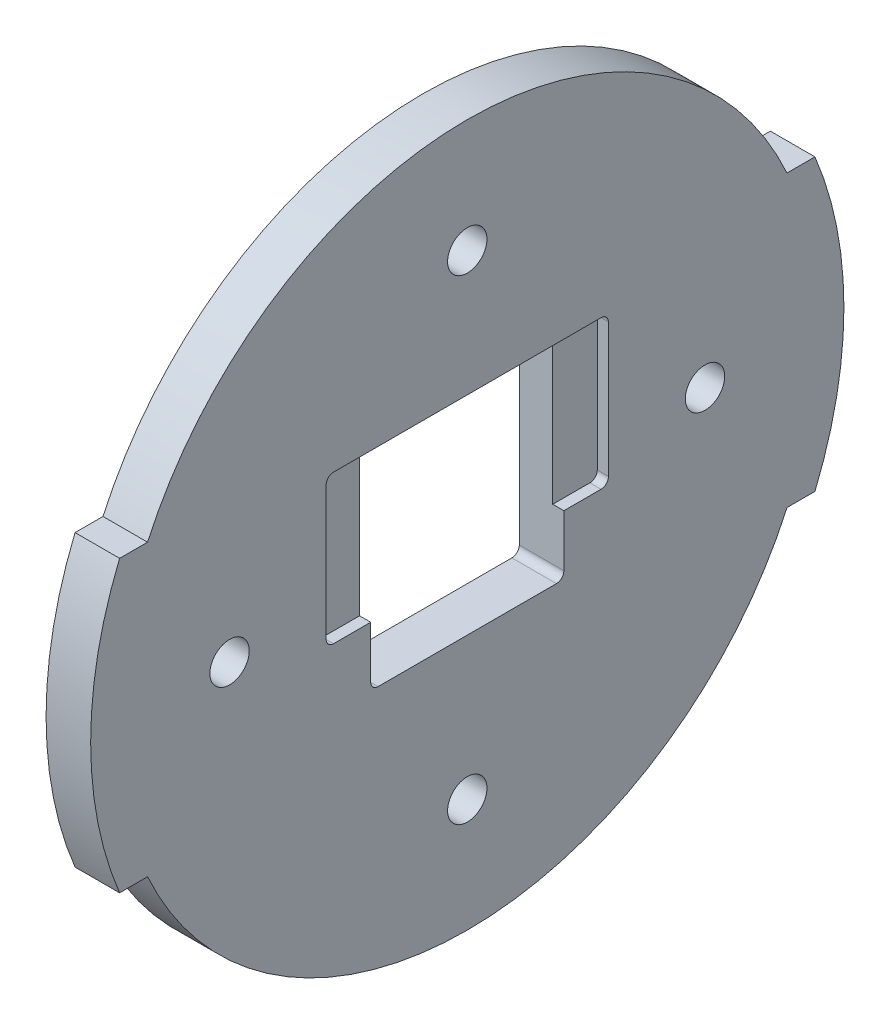
ISO-10303-21;
HEADER;
FILE_DESCRIPTION(('STEP AP214'),'2;1');
FILE_NAME('part.step','',(''),(''),'','','');
FILE_SCHEMA(('AUTOMOTIVE_DESIGN { 1 0 10303 214 1 1 1 1 }'));
ENDSEC;
DATA;
#1=APPLICATION_CONTEXT('core data for automotive mechanical design processes');
#2=APPLICATION_PROTOCOL_DEFINITION('international standard','automotive_design',2000,#1);
#3=PRODUCT_CONTEXT('',#1,'mechanical');
#4=PRODUCT('Part','Part','',(#3));
#5=PRODUCT_RELATED_PRODUCT_CATEGORY('part','',(#4));
#6=PRODUCT_DEFINITION_FORMATION('','',#4);
#7=PRODUCT_DEFINITION_CONTEXT('part definition',#1,'design');
#8=PRODUCT_DEFINITION('design','',#6,#7);
#9=PRODUCT_DEFINITION_SHAPE('','',#8);
#10=(LENGTH_UNIT() NAMED_UNIT(*) SI_UNIT(.MILLI.,.METRE.));
#11=(NAMED_UNIT(*) PLANE_ANGLE_UNIT() SI_UNIT($,.RADIAN.));
#12=(NAMED_UNIT(*) SI_UNIT($,.STERADIAN.) SOLID_ANGLE_UNIT());
#13=UNCERTAINTY_MEASURE_WITH_UNIT(LENGTH_MEASURE(1.E-05),#10,'distance_accuracy_value','');
#14=(GEOMETRIC_REPRESENTATION_CONTEXT(3) GLOBAL_UNCERTAINTY_ASSIGNED_CONTEXT((#13)) GLOBAL_UNIT_ASSIGNED_CONTEXT((#10,
#11,#12)) REPRESENTATION_CONTEXT('',''));
#15=CARTESIAN_POINT('',(0.,0.,0.));
#16=DIRECTION('',(0.,0.,1.));
#17=DIRECTION('',(1.,0.,0.));
#18=AXIS2_PLACEMENT_3D('',#15,#16,#17);
#19=CARTESIAN_POINT('',(6.,0.,0.));
#20=DIRECTION('',(1.,0.,0.));
#21=DIRECTION('',(0.,0.,-1.));
#22=AXIS2_PLACEMENT_3D('',#19,#20,#21);
#23=PLANE('',#22);
#24=CARTESIAN_POINT('',(6.,0.,-32.));
#25=DIRECTION('',(1.,0.,0.));
#26=DIRECTION('',(0.,0.,-1.));
#27=AXIS2_PLACEMENT_3D('',#24,#25,#26);
#28=CIRCLE('',#27,2.64999999999999);
#29=CARTESIAN_POINT('',(6.,0.,-34.65));
#30=VERTEX_POINT('',#29);
#31=EDGE_CURVE('E416',#30,#30,#28,.T.);
#32=ORIENTED_EDGE('',*,*,#31,.F.);
#33=EDGE_LOOP('',(#32));
#34=FACE_BOUND('',#33,.T.);
#35=CARTESIAN_POINT('',(6.,32.,1.1172740284298E-13));
#36=DIRECTION('',(1.,0.,0.));
#37=DIRECTION('',(0.,0.,-1.));
#38=AXIS2_PLACEMENT_3D('',#35,#36,#37);
#39=CIRCLE('',#38,2.64999999999999);
#40=CARTESIAN_POINT('',(6.,32.,-2.64999999999987));
#41=VERTEX_POINT('',#40);
#42=EDGE_CURVE('E422',#41,#41,#39,.T.);
#43=ORIENTED_EDGE('',*,*,#42,.F.);
#44=EDGE_LOOP('',(#43));
#45=FACE_BOUND('',#44,.T.);
#46=CARTESIAN_POINT('',(6.,-2.23454805685961E-13,32.));
#47=DIRECTION('',(1.,0.,0.));
#48=DIRECTION('',(0.,0.,-1.));
#49=AXIS2_PLACEMENT_3D('',#46,#47,#48);
#50=CIRCLE('',#49,2.64999999999999);
#51=CARTESIAN_POINT('',(6.,-2.23454805685961E-13,29.35));
#52=VERTEX_POINT('',#51);
#53=EDGE_CURVE('E428',#52,#52,#50,.T.);
#54=ORIENTED_EDGE('',*,*,#53,.F.);
#55=EDGE_LOOP('',(#54));
#56=FACE_BOUND('',#55,.T.);
#57=CARTESIAN_POINT('',(6.,-32.,-3.35182208528941E-13));
#58=DIRECTION('',(1.,0.,0.));
#59=DIRECTION('',(0.,0.,-1.));
#60=AXIS2_PLACEMENT_3D('',#57,#58,#59);
#61=CIRCLE('',#60,2.64999999999999);
#62=CARTESIAN_POINT('',(6.,-32.,-2.65000000000032));
#63=VERTEX_POINT('',#62);
#64=EDGE_CURVE('E434',#63,#63,#61,.T.);
#65=ORIENTED_EDGE('',*,*,#64,.F.);
#66=EDGE_LOOP('',(#65));
#67=FACE_BOUND('',#66,.T.);
#68=CARTESIAN_POINT('',(6.,0.,0.));
#69=DIRECTION('',(1.,0.,0.));
#70=DIRECTION('',(0.,0.,-1.));
#71=AXIS2_PLACEMENT_3D('',#68,#69,#70);
#72=CIRCLE('',#71,50.7);
#73=CARTESIAN_POINT('',(6.,19.5,46.8));
#74=VERTEX_POINT('',#73);
#75=CARTESIAN_POINT('',(6.,-19.5,46.8));
#76=VERTEX_POINT('',#75);
#77=EDGE_CURVE('E264',#74,#76,#72,.T.);
#78=ORIENTED_EDGE('',*,*,#77,.T.);
#79=DIRECTION('',(0.,0.,-1.));
#80=VECTOR('',#79,1.);
#81=CARTESIAN_POINT('',(6.,-19.5,46.8));
#82=LINE('',#81,#80);
#83=CARTESIAN_POINT('',(6.,-19.5,43.0385002062107));
#84=VERTEX_POINT('',#83);
#85=EDGE_CURVE('E267',#76,#84,#82,.T.);
#86=ORIENTED_EDGE('',*,*,#85,.T.);
#87=CARTESIAN_POINT('',(6.,0.,0.));
#88=DIRECTION('',(1.,0.,0.));
#89=DIRECTION('',(0.,0.,-1.));
#90=AXIS2_PLACEMENT_3D('',#87,#88,#89);
#91=CIRCLE('',#90,47.25);
#92=CARTESIAN_POINT('',(6.,-19.5,-43.0385002062107));
#93=VERTEX_POINT('',#92);
#94=EDGE_CURVE('E270',#84,#93,#91,.T.);
#95=ORIENTED_EDGE('',*,*,#94,.T.);
#96=DIRECTION('',(0.,0.,-1.));
#97=VECTOR('',#96,1.);
#98=CARTESIAN_POINT('',(6.,-19.5,-46.8));
#99=LINE('',#98,#97);
#100=CARTESIAN_POINT('',(6.,-19.5,-46.8));
#101=VERTEX_POINT('',#100);
#102=EDGE_CURVE('E272',#93,#101,#99,.T.);
#103=ORIENTED_EDGE('',*,*,#102,.T.);
#104=CARTESIAN_POINT('',(6.,0.,0.));
#105=DIRECTION('',(1.,0.,0.));
#106=DIRECTION('',(0.,0.,-1.));
#107=AXIS2_PLACEMENT_3D('',#104,#105,#106);
#108=CIRCLE('',#107,50.7);
#109=CARTESIAN_POINT('',(6.,19.5,-46.8));
#110=VERTEX_POINT('',#109);
#111=EDGE_CURVE('E274',#101,#110,#108,.T.);
#112=ORIENTED_EDGE('',*,*,#111,.T.);
#113=DIRECTION('',(0.,0.,1.));
#114=VECTOR('',#113,1.);
#115=CARTESIAN_POINT('',(6.,19.5,-46.8));
#116=LINE('',#115,#114);
#117=CARTESIAN_POINT('',(6.,19.5,-43.0385002062107));
#118=VERTEX_POINT('',#117);
#119=EDGE_CURVE('E276',#110,#118,#116,.T.);
#120=ORIENTED_EDGE('',*,*,#119,.T.);
#121=CARTESIAN_POINT('',(6.,0.,0.));
#122=DIRECTION('',(1.,0.,0.));
#123=DIRECTION('',(0.,0.,-1.));
#124=AXIS2_PLACEMENT_3D('',#121,#122,#123);
#125=CIRCLE('',#124,47.25);
#126=CARTESIAN_POINT('',(6.,19.5,43.0385002062107));
#127=VERTEX_POINT('',#126);
#128=EDGE_CURVE('E278',#118,#127,#125,.T.);
#129=ORIENTED_EDGE('',*,*,#128,.T.);
#130=DIRECTION('',(0.,0.,1.));
#131=VECTOR('',#130,1.);
#132=CARTESIAN_POINT('',(6.,19.5,46.8));
#133=LINE('',#132,#131);
#134=EDGE_CURVE('E280',#127,#74,#133,.T.);
#135=ORIENTED_EDGE('',*,*,#134,.T.);
#136=EDGE_LOOP('',(#78,#86,#95,#103,#112,#120,#129,#135));
#137=FACE_BOUND('',#136,.T.);
#138=DIRECTION('',(0.,1.,0.));
#139=VECTOR('',#138,1.);
#140=CARTESIAN_POINT('',(6.,0.,13.));
#141=LINE('',#140,#139);
#142=CARTESIAN_POINT('',(6.,-11.85,13.));
#143=VERTEX_POINT('',#142);
#144=CARTESIAN_POINT('',(6.,-4.85,13.));
#145=VERTEX_POINT('',#144);
#146=EDGE_CURVE('E437',#143,#145,#141,.T.);
#147=ORIENTED_EDGE('',*,*,#146,.T.);
#148=DIRECTION('',(0.,0.,1.));
#149=VECTOR('',#148,1.);
#150=CARTESIAN_POINT('',(6.,-4.85000000000001,0.));
#151=LINE('',#150,#149);
#152=CARTESIAN_POINT('',(6.,-4.85,18.));
#153=VERTEX_POINT('',#152);
#154=EDGE_CURVE('E218',#145,#153,#151,.T.);
#155=ORIENTED_EDGE('',*,*,#154,.T.);
#156=CARTESIAN_POINT('',(6.,-3.85,18.));
#157=DIRECTION('',(1.,0.,0.));
#158=DIRECTION('',(0.,0.,-1.));
#159=AXIS2_PLACEMENT_3D('',#156,#157,#158);
#160=CIRCLE('',#159,1.);
#161=CARTESIAN_POINT('',(6.,-3.85,19.));
#162=VERTEX_POINT('',#161);
#163=EDGE_CURVE('E369',#153,#162,#160,.F.);
#164=ORIENTED_EDGE('',*,*,#163,.T.);
#165=DIRECTION('',(0.,-1.,0.));
#166=VECTOR('',#165,1.);
#167=CARTESIAN_POINT('',(6.,0.,19.));
#168=LINE('',#167,#166);
#169=CARTESIAN_POINT('',(6.,14.15,19.));
#170=VERTEX_POINT('',#169);
#171=EDGE_CURVE('E377',#170,#162,#168,.T.);
#172=ORIENTED_EDGE('',*,*,#171,.F.);
#173=CARTESIAN_POINT('',(6.,14.15,18.));
#174=DIRECTION('',(1.,0.,0.));
#175=DIRECTION('',(0.,0.,-1.));
#176=AXIS2_PLACEMENT_3D('',#173,#174,#175);
#177=CIRCLE('',#176,1.);
#178=CARTESIAN_POINT('',(6.,15.15,18.));
#179=VERTEX_POINT('',#178);
#180=EDGE_CURVE('E11',#170,#179,#177,.F.);
#181=ORIENTED_EDGE('',*,*,#180,.T.);
#182=DIRECTION('',(0.,0.,1.));
#183=VECTOR('',#182,1.);
#184=CARTESIAN_POINT('',(6.,15.15,0.));
#185=LINE('',#184,#183);
#186=CARTESIAN_POINT('',(6.,15.15,-18.));
#187=VERTEX_POINT('',#186);
#188=EDGE_CURVE('E235',#187,#179,#185,.T.);
#189=ORIENTED_EDGE('',*,*,#188,.F.);
#190=CARTESIAN_POINT('',(6.,14.15,-18.));
#191=DIRECTION('',(1.,0.,0.));
#192=DIRECTION('',(0.,0.,-1.));
#193=AXIS2_PLACEMENT_3D('',#190,#191,#192);
#194=CIRCLE('',#193,1.);
#195=CARTESIAN_POINT('',(6.,14.15,-19.));
#196=VERTEX_POINT('',#195);
#197=EDGE_CURVE('E44',#187,#196,#194,.F.);
#198=ORIENTED_EDGE('',*,*,#197,.T.);
#199=DIRECTION('',(0.,-1.,0.));
#200=VECTOR('',#199,1.);
#201=CARTESIAN_POINT('',(6.,0.,-19.));
#202=LINE('',#201,#200);
#203=CARTESIAN_POINT('',(6.,-3.85000000000001,-19.));
#204=VERTEX_POINT('',#203);
#205=EDGE_CURVE('E217',#196,#204,#202,.T.);
#206=ORIENTED_EDGE('',*,*,#205,.T.);
#207=CARTESIAN_POINT('',(6.,-3.85000000000001,-18.));
#208=DIRECTION('',(1.,0.,0.));
#209=DIRECTION('',(0.,0.,-1.));
#210=AXIS2_PLACEMENT_3D('',#207,#208,#209);
#211=CIRCLE('',#210,1.);
#212=CARTESIAN_POINT('',(6.,-4.85000000000001,-18.));
#213=VERTEX_POINT('',#212);
#214=EDGE_CURVE('E214',#204,#213,#211,.F.);
#215=ORIENTED_EDGE('',*,*,#214,.T.);
#216=CARTESIAN_POINT('',(6.,-4.85000000000001,-13.));
#217=VERTEX_POINT('',#216);
#218=EDGE_CURVE('E207',#213,#217,#151,.T.);
#219=ORIENTED_EDGE('',*,*,#218,.T.);
#220=DIRECTION('',(0.,1.,0.));
#221=VECTOR('',#220,1.);
#222=CARTESIAN_POINT('',(6.,0.,-13.));
#223=LINE('',#222,#221);
#224=CARTESIAN_POINT('',(6.,-11.85,-13.));
#225=VERTEX_POINT('',#224);
#226=EDGE_CURVE('E212',#225,#217,#223,.T.);
#227=ORIENTED_EDGE('',*,*,#226,.F.);
#228=CARTESIAN_POINT('',(6.,-11.85,-12.));
#229=DIRECTION('',(1.,0.,0.));
#230=DIRECTION('',(0.,0.,-1.));
#231=AXIS2_PLACEMENT_3D('',#228,#229,#230);
#232=CIRCLE('',#231,1.);
#233=CARTESIAN_POINT('',(6.,-12.85,-12.));
#234=VERTEX_POINT('',#233);
#235=EDGE_CURVE('E236',#225,#234,#232,.F.);
#236=ORIENTED_EDGE('',*,*,#235,.T.);
#237=DIRECTION('',(0.,0.,1.));
#238=VECTOR('',#237,1.);
#239=CARTESIAN_POINT('',(6.,-12.85,0.));
#240=LINE('',#239,#238);
#241=CARTESIAN_POINT('',(6.,-12.85,12.));
#242=VERTEX_POINT('',#241);
#243=EDGE_CURVE('E240',#234,#242,#240,.T.);
#244=ORIENTED_EDGE('',*,*,#243,.T.);
#245=CARTESIAN_POINT('',(6.,-11.85,12.));
#246=DIRECTION('',(1.,0.,0.));
#247=DIRECTION('',(0.,0.,-1.));
#248=AXIS2_PLACEMENT_3D('',#245,#246,#247);
#249=CIRCLE('',#248,1.);
#250=EDGE_CURVE('E439',#143,#242,#249,.T.);
#251=ORIENTED_EDGE('',*,*,#250,.F.);
#252=EDGE_LOOP('',(#147,#155,#164,#172,#181,#189,#198,#206,#215,#219,#227,#236,#244,#251));
#253=FACE_BOUND('',#252,.T.);
#254=ADVANCED_FACE('F36',(#34,#45,#56,#67,#137,#253),#23,.T.);
#255=CARTESIAN_POINT('',(-14.,0.,13.));
#256=DIRECTION('',(0.,0.,-1.));
#257=DIRECTION('',(-1.,0.,0.));
#258=AXIS2_PLACEMENT_3D('',#255,#256,#257);
#259=PLANE('',#258);
#260=DIRECTION('',(0.,-1.,0.));
#261=VECTOR('',#260,1.);
#262=CARTESIAN_POINT('',(4.5,0.,13.));
#263=LINE('',#262,#261);
#264=CARTESIAN_POINT('',(4.5,14.15,13.));
#265=VERTEX_POINT('',#264);
#266=CARTESIAN_POINT('',(4.5,-4.85,13.));
#267=VERTEX_POINT('',#266);
#268=EDGE_CURVE('E407',#265,#267,#263,.T.);
#269=ORIENTED_EDGE('',*,*,#268,.T.);
#270=DIRECTION('',(1.,0.,0.));
#271=VECTOR('',#270,1.);
#272=CARTESIAN_POINT('',(-14.,-4.85,13.));
#273=LINE('',#272,#271);
#274=EDGE_CURVE('E410',#267,#145,#273,.T.);
#275=ORIENTED_EDGE('',*,*,#274,.T.);
#276=ORIENTED_EDGE('',*,*,#146,.F.);
#277=DIRECTION('',(1.,0.,0.));
#278=VECTOR('',#277,1.);
#279=CARTESIAN_POINT('',(-14.,-11.85,13.));
#280=LINE('',#279,#278);
#281=CARTESIAN_POINT('',(0.,-11.85,13.));
#282=VERTEX_POINT('',#281);
#283=EDGE_CURVE('E238',#282,#143,#280,.T.);
#284=ORIENTED_EDGE('',*,*,#283,.F.);
#285=DIRECTION('',(0.,1.,0.));
#286=VECTOR('',#285,1.);
#287=CARTESIAN_POINT('',(0.,0.,13.));
#288=LINE('',#287,#286);
#289=CARTESIAN_POINT('',(0.,14.15,13.));
#290=VERTEX_POINT('',#289);
#291=EDGE_CURVE('E340',#282,#290,#288,.T.);
#292=ORIENTED_EDGE('',*,*,#291,.T.);
#293=DIRECTION('',(1.,0.,0.));
#294=VECTOR('',#293,1.);
#295=CARTESIAN_POINT('',(-14.,14.15,13.));
#296=LINE('',#295,#294);
#297=EDGE_CURVE('E244',#290,#265,#296,.T.);
#298=ORIENTED_EDGE('',*,*,#297,.T.);
#299=EDGE_LOOP('',(#269,#275,#276,#284,#292,#298));
#300=FACE_BOUND('',#299,.T.);
#301=ADVANCED_FACE('F453',(#300),#259,.T.);
#302=CARTESIAN_POINT('',(-14.,14.15,12.));
#303=DIRECTION('',(1.,0.,0.));
#304=DIRECTION('',(0.,0.,-1.));
#305=AXIS2_PLACEMENT_3D('',#302,#303,#304);
#306=CYLINDRICAL_SURFACE('',#305,1.);
#307=DIRECTION('',(1.,0.,0.));
#308=VECTOR('',#307,1.);
#309=CARTESIAN_POINT('',(-14.,15.15,12.));
#310=LINE('',#309,#308);
#311=CARTESIAN_POINT('',(0.,15.15,12.));
#312=VERTEX_POINT('',#311);
#313=CARTESIAN_POINT('',(4.5,15.15,12.));
#314=VERTEX_POINT('',#313);
#315=EDGE_CURVE('E248',#312,#314,#310,.T.);
#316=ORIENTED_EDGE('',*,*,#315,.T.);
#317=CARTESIAN_POINT('',(4.5,14.15,12.));
#318=DIRECTION('',(1.,0.,0.));
#319=DIRECTION('',(0.,0.,-1.));
#320=AXIS2_PLACEMENT_3D('',#317,#318,#319);
#321=CIRCLE('',#320,1.);
#322=EDGE_CURVE('E404',#314,#265,#321,.T.);
#323=ORIENTED_EDGE('',*,*,#322,.T.);
#324=ORIENTED_EDGE('',*,*,#297,.F.);
#325=CARTESIAN_POINT('',(0.,14.15,12.));
#326=DIRECTION('',(1.,0.,0.));
#327=DIRECTION('',(0.,0.,-1.));
#328=AXIS2_PLACEMENT_3D('',#325,#326,#327);
#329=CIRCLE('',#328,1.);
#330=EDGE_CURVE('E338',#290,#312,#329,.F.);
#331=ORIENTED_EDGE('',*,*,#330,.T.);
#332=EDGE_LOOP('',(#316,#323,#324,#331));
#333=FACE_BOUND('',#332,.T.);
#334=ADVANCED_FACE('F460',(#333),#306,.F.);
#335=CARTESIAN_POINT('',(-14.,14.15,-12.));
#336=DIRECTION('',(1.,0.,0.));
#337=DIRECTION('',(0.,0.,-1.));
#338=AXIS2_PLACEMENT_3D('',#335,#336,#337);
#339=CYLINDRICAL_SURFACE('',#338,1.);
#340=CARTESIAN_POINT('',(4.5,14.15,-12.));
#341=DIRECTION('',(1.,0.,0.));
#342=DIRECTION('',(0.,0.,-1.));
#343=AXIS2_PLACEMENT_3D('',#340,#341,#342);
#344=CIRCLE('',#343,1.);
#345=CARTESIAN_POINT('',(4.5,15.15,-12.));
#346=VERTEX_POINT('',#345);
#347=CARTESIAN_POINT('',(4.5,14.15,-13.));
#348=VERTEX_POINT('',#347);
#349=EDGE_CURVE('E394',#346,#348,#344,.F.);
#350=ORIENTED_EDGE('',*,*,#349,.F.);
#351=DIRECTION('',(1.,0.,0.));
#352=VECTOR('',#351,1.);
#353=CARTESIAN_POINT('',(-14.,15.15,-12.));
#354=LINE('',#353,#352);
#355=CARTESIAN_POINT('',(0.,15.15,-12.));
#356=VERTEX_POINT('',#355);
#357=EDGE_CURVE('E251',#356,#346,#354,.T.);
#358=ORIENTED_EDGE('',*,*,#357,.F.);
#359=CARTESIAN_POINT('',(0.,14.15,-12.));
#360=DIRECTION('',(1.,0.,0.));
#361=DIRECTION('',(0.,0.,-1.));
#362=AXIS2_PLACEMENT_3D('',#359,#360,#361);
#363=CIRCLE('',#362,1.);
#364=CARTESIAN_POINT('',(0.,14.15,-13.));
#365=VERTEX_POINT('',#364);
#366=EDGE_CURVE('E332',#365,#356,#363,.T.);
#367=ORIENTED_EDGE('',*,*,#366,.F.);
#368=DIRECTION('',(1.,0.,0.));
#369=VECTOR('',#368,1.);
#370=CARTESIAN_POINT('',(-14.,14.15,-13.));
#371=LINE('',#370,#369);
#372=EDGE_CURVE('E254',#365,#348,#371,.T.);
#373=ORIENTED_EDGE('',*,*,#372,.T.);
#374=EDGE_LOOP('',(#350,#358,#367,#373));
#375=FACE_BOUND('',#374,.T.);
#376=ADVANCED_FACE('F486',(#375),#339,.F.);
#377=CARTESIAN_POINT('',(-14.,0.,-13.));
#378=DIRECTION('',(0.,0.,-1.));
#379=DIRECTION('',(-1.,0.,0.));
#380=AXIS2_PLACEMENT_3D('',#377,#378,#379);
#381=PLANE('',#380);
#382=DIRECTION('',(1.,0.,0.));
#383=VECTOR('',#382,1.);
#384=CARTESIAN_POINT('',(-14.,-4.85000000000001,-13.));
#385=LINE('',#384,#383);
#386=CARTESIAN_POINT('',(4.5,-4.85000000000001,-13.));
#387=VERTEX_POINT('',#386);
#388=EDGE_CURVE('E221',#387,#217,#385,.T.);
#389=ORIENTED_EDGE('',*,*,#388,.F.);
#390=DIRECTION('',(0.,-1.,0.));
#391=VECTOR('',#390,1.);
#392=CARTESIAN_POINT('',(4.5,0.,-13.));
#393=LINE('',#392,#391);
#394=EDGE_CURVE('E229',#348,#387,#393,.T.);
#395=ORIENTED_EDGE('',*,*,#394,.F.);
#396=ORIENTED_EDGE('',*,*,#372,.F.);
#397=DIRECTION('',(0.,1.,0.));
#398=VECTOR('',#397,1.);
#399=CARTESIAN_POINT('',(0.,0.,-13.));
#400=LINE('',#399,#398);
#401=CARTESIAN_POINT('',(0.,-11.85,-13.));
#402=VERTEX_POINT('',#401);
#403=EDGE_CURVE('E329',#402,#365,#400,.T.);
#404=ORIENTED_EDGE('',*,*,#403,.F.);
#405=DIRECTION('',(1.,0.,0.));
#406=VECTOR('',#405,1.);
#407=CARTESIAN_POINT('',(-14.,-11.85,-13.));
#408=LINE('',#407,#406);
#409=EDGE_CURVE('E233',#402,#225,#408,.T.);
#410=ORIENTED_EDGE('',*,*,#409,.T.);
#411=ORIENTED_EDGE('',*,*,#226,.T.);
#412=EDGE_LOOP('',(#389,#395,#396,#404,#410,#411));
#413=FACE_BOUND('',#412,.T.);
#414=ADVANCED_FACE('F231',(#413),#381,.F.);
#415=CARTESIAN_POINT('',(0.,0.,0.));
#416=DIRECTION('',(1.,0.,0.));
#417=DIRECTION('',(0.,0.,-1.));
#418=AXIS2_PLACEMENT_3D('',#415,#416,#417);
#419=PLANE('',#418);
#420=CARTESIAN_POINT('',(0.,0.,-32.));
#421=DIRECTION('',(-1.,0.,0.));
#422=DIRECTION('',(0.,0.,1.));
#423=AXIS2_PLACEMENT_3D('',#420,#421,#422);
#424=CIRCLE('',#423,2.64999999999999);
#425=CARTESIAN_POINT('',(0.,0.,-29.35));
#426=VERTEX_POINT('',#425);
#427=EDGE_CURVE('E413',#426,#426,#424,.T.);
#428=ORIENTED_EDGE('',*,*,#427,.F.);
#429=EDGE_LOOP('',(#428));
#430=FACE_BOUND('',#429,.T.);
#431=CARTESIAN_POINT('',(0.,32.,1.1172740284298E-13));
#432=DIRECTION('',(-1.,0.,0.));
#433=DIRECTION('',(0.,0.,1.));
#434=AXIS2_PLACEMENT_3D('',#431,#432,#433);
#435=CIRCLE('',#434,2.64999999999999);
#436=CARTESIAN_POINT('',(0.,32.,2.6500000000001));
#437=VERTEX_POINT('',#436);
#438=EDGE_CURVE('E419',#437,#437,#435,.T.);
#439=ORIENTED_EDGE('',*,*,#438,.F.);
#440=EDGE_LOOP('',(#439));
#441=FACE_BOUND('',#440,.T.);
#442=CARTESIAN_POINT('',(0.,-2.23454805685961E-13,32.));
#443=DIRECTION('',(-1.,0.,0.));
#444=DIRECTION('',(0.,0.,1.));
#445=AXIS2_PLACEMENT_3D('',#442,#443,#444);
#446=CIRCLE('',#445,2.64999999999999);
#447=CARTESIAN_POINT('',(0.,-2.23454805685961E-13,34.65));
#448=VERTEX_POINT('',#447);
#449=EDGE_CURVE('E425',#448,#448,#446,.T.);
#450=ORIENTED_EDGE('',*,*,#449,.F.);
#451=EDGE_LOOP('',(#450));
#452=FACE_BOUND('',#451,.T.);
#453=CARTESIAN_POINT('',(0.,-32.,-3.35182208528941E-13));
#454=DIRECTION('',(-1.,0.,0.));
#455=DIRECTION('',(0.,0.,1.));
#456=AXIS2_PLACEMENT_3D('',#453,#454,#455);
#457=CIRCLE('',#456,2.64999999999999);
#458=CARTESIAN_POINT('',(0.,-32.,2.64999999999965));
#459=VERTEX_POINT('',#458);
#460=EDGE_CURVE('E431',#459,#459,#457,.T.);
#461=ORIENTED_EDGE('',*,*,#460,.F.);
#462=EDGE_LOOP('',(#461));
#463=FACE_BOUND('',#462,.T.);
#464=CARTESIAN_POINT('',(0.,0.,0.));
#465=DIRECTION('',(1.,0.,0.));
#466=DIRECTION('',(0.,0.,-1.));
#467=AXIS2_PLACEMENT_3D('',#464,#465,#466);
#468=CIRCLE('',#467,50.7);
#469=CARTESIAN_POINT('',(0.,19.5,46.8));
#470=VERTEX_POINT('',#469);
#471=CARTESIAN_POINT('',(0.,-19.5,46.8));
#472=VERTEX_POINT('',#471);
#473=EDGE_CURVE('E247',#470,#472,#468,.T.);
#474=ORIENTED_EDGE('',*,*,#473,.F.);
#475=DIRECTION('',(0.,0.,1.));
#476=VECTOR('',#475,1.);
#477=CARTESIAN_POINT('',(0.,19.5,46.8));
#478=LINE('',#477,#476);
#479=CARTESIAN_POINT('',(0.,19.5,43.0385002062107));
#480=VERTEX_POINT('',#479);
#481=EDGE_CURVE('E268',#480,#470,#478,.T.);
#482=ORIENTED_EDGE('',*,*,#481,.F.);
#483=CARTESIAN_POINT('',(0.,0.,0.));
#484=DIRECTION('',(1.,0.,0.));
#485=DIRECTION('',(0.,0.,-1.));
#486=AXIS2_PLACEMENT_3D('',#483,#484,#485);
#487=CIRCLE('',#486,47.25);
#488=CARTESIAN_POINT('',(0.,19.5,-43.0385002062107));
#489=VERTEX_POINT('',#488);
#490=EDGE_CURVE('E295',#489,#480,#487,.T.);
#491=ORIENTED_EDGE('',*,*,#490,.F.);
#492=DIRECTION('',(0.,0.,1.));
#493=VECTOR('',#492,1.);
#494=CARTESIAN_POINT('',(0.,19.5,-46.8));
#495=LINE('',#494,#493);
#496=CARTESIAN_POINT('',(0.,19.5,-46.8));
#497=VERTEX_POINT('',#496);
#498=EDGE_CURVE('E293',#497,#489,#495,.T.);
#499=ORIENTED_EDGE('',*,*,#498,.F.);
#500=CARTESIAN_POINT('',(0.,0.,0.));
#501=DIRECTION('',(1.,0.,0.));
#502=DIRECTION('',(0.,0.,-1.));
#503=AXIS2_PLACEMENT_3D('',#500,#501,#502);
#504=CIRCLE('',#503,50.7);
#505=CARTESIAN_POINT('',(0.,-19.5,-46.8));
#506=VERTEX_POINT('',#505);
#507=EDGE_CURVE('E291',#506,#497,#504,.T.);
#508=ORIENTED_EDGE('',*,*,#507,.F.);
#509=DIRECTION('',(0.,0.,-1.));
#510=VECTOR('',#509,1.);
#511=CARTESIAN_POINT('',(0.,-19.5,-46.8));
#512=LINE('',#511,#510);
#513=CARTESIAN_POINT('',(0.,-19.5,-43.0385002062107));
#514=VERTEX_POINT('',#513);
#515=EDGE_CURVE('E289',#514,#506,#512,.T.);
#516=ORIENTED_EDGE('',*,*,#515,.F.);
#517=CARTESIAN_POINT('',(0.,0.,0.));
#518=DIRECTION('',(1.,0.,0.));
#519=DIRECTION('',(0.,0.,-1.));
#520=AXIS2_PLACEMENT_3D('',#517,#518,#519);
#521=CIRCLE('',#520,47.25);
#522=CARTESIAN_POINT('',(0.,-19.5,43.0385002062107));
#523=VERTEX_POINT('',#522);
#524=EDGE_CURVE('E287',#523,#514,#521,.T.);
#525=ORIENTED_EDGE('',*,*,#524,.F.);
#526=DIRECTION('',(0.,0.,-1.));
#527=VECTOR('',#526,1.);
#528=CARTESIAN_POINT('',(0.,-19.5,46.8));
#529=LINE('',#528,#527);
#530=EDGE_CURVE('E285',#472,#523,#529,.T.);
#531=ORIENTED_EDGE('',*,*,#530,.F.);
#532=EDGE_LOOP('',(#474,#482,#491,#499,#508,#516,#525,#531));
#533=FACE_BOUND('',#532,.T.);
#534=ORIENTED_EDGE('',*,*,#291,.F.);
#535=CARTESIAN_POINT('',(0.,-11.85,12.));
#536=DIRECTION('',(1.,0.,0.));
#537=DIRECTION('',(0.,0.,-1.));
#538=AXIS2_PLACEMENT_3D('',#535,#536,#537);
#539=CIRCLE('',#538,1.);
#540=CARTESIAN_POINT('',(0.,-12.85,12.));
#541=VERTEX_POINT('',#540);
#542=EDGE_CURVE('E321',#282,#541,#539,.T.);
#543=ORIENTED_EDGE('',*,*,#542,.T.);
#544=DIRECTION('',(0.,0.,1.));
#545=VECTOR('',#544,1.);
#546=CARTESIAN_POINT('',(0.,-12.85,0.));
#547=LINE('',#546,#545);
#548=CARTESIAN_POINT('',(0.,-12.85,-12.));
#549=VERTEX_POINT('',#548);
#550=EDGE_CURVE('E324',#549,#541,#547,.T.);
#551=ORIENTED_EDGE('',*,*,#550,.F.);
#552=CARTESIAN_POINT('',(0.,-11.85,-12.));
#553=DIRECTION('',(1.,0.,0.));
#554=DIRECTION('',(0.,0.,-1.));
#555=AXIS2_PLACEMENT_3D('',#552,#553,#554);
#556=CIRCLE('',#555,1.);
#557=EDGE_CURVE('E327',#402,#549,#556,.F.);
#558=ORIENTED_EDGE('',*,*,#557,.F.);
#559=ORIENTED_EDGE('',*,*,#403,.T.);
#560=ORIENTED_EDGE('',*,*,#366,.T.);
#561=DIRECTION('',(0.,0.,1.));
#562=VECTOR('',#561,1.);
#563=CARTESIAN_POINT('',(0.,15.15,0.));
#564=LINE('',#563,#562);
#565=EDGE_CURVE('E335',#356,#312,#564,.T.);
#566=ORIENTED_EDGE('',*,*,#565,.T.);
#567=ORIENTED_EDGE('',*,*,#330,.F.);
#568=EDGE_LOOP('',(#534,#543,#551,#558,#559,#560,#566,#567));
#569=FACE_BOUND('',#568,.T.);
#570=ADVANCED_FACE('F457',(#430,#441,#452,#463,#533,#569),#419,.F.);
#571=CARTESIAN_POINT('',(6.,0.,0.));
#572=DIRECTION('',(-1.,0.,0.));
#573=DIRECTION('',(0.,0.,1.));
#574=AXIS2_PLACEMENT_3D('',#571,#572,#573);
#575=CYLINDRICAL_SURFACE('',#574,50.7);
#576=ORIENTED_EDGE('',*,*,#473,.T.);
#577=DIRECTION('',(-1.,0.,0.));
#578=VECTOR('',#577,1.);
#579=CARTESIAN_POINT('',(6.,-19.5,46.8));
#580=LINE('',#579,#578);
#581=EDGE_CURVE('E318',#76,#472,#580,.T.);
#582=ORIENTED_EDGE('',*,*,#581,.F.);
#583=ORIENTED_EDGE('',*,*,#77,.F.);
#584=DIRECTION('',(-1.,0.,0.));
#585=VECTOR('',#584,1.);
#586=CARTESIAN_POINT('',(6.,19.5,46.8));
#587=LINE('',#586,#585);
#588=EDGE_CURVE('E282',#74,#470,#587,.T.);
#589=ORIENTED_EDGE('',*,*,#588,.T.);
#590=EDGE_LOOP('',(#576,#582,#583,#589));
#591=FACE_BOUND('',#590,.T.);
#592=ADVANCED_FACE('F513',(#591),#575,.T.);
#593=CARTESIAN_POINT('',(6.,-19.5,46.8));
#594=DIRECTION('',(0.,1.,0.));
#595=DIRECTION('',(0.,0.,1.));
#596=AXIS2_PLACEMENT_3D('',#593,#594,#595);
#597=PLANE('',#596);
#598=ORIENTED_EDGE('',*,*,#530,.T.);
#599=DIRECTION('',(-1.,0.,0.));
#600=VECTOR('',#599,1.);
#601=CARTESIAN_POINT('',(6.,-19.5,43.0385002062107));
#602=LINE('',#601,#600);
#603=EDGE_CURVE('E315',#84,#523,#602,.T.);
#604=ORIENTED_EDGE('',*,*,#603,.F.);
#605=ORIENTED_EDGE('',*,*,#85,.F.);
#606=ORIENTED_EDGE('',*,*,#581,.T.);
#607=EDGE_LOOP('',(#598,#604,#605,#606));
#608=FACE_BOUND('',#607,.T.);
#609=ADVANCED_FACE('F537',(#608),#597,.F.);
#610=CARTESIAN_POINT('',(6.,0.,0.));
#611=DIRECTION('',(-1.,0.,0.));
#612=DIRECTION('',(0.,0.,1.));
#613=AXIS2_PLACEMENT_3D('',#610,#611,#612);
#614=CYLINDRICAL_SURFACE('',#613,47.25);
#615=ORIENTED_EDGE('',*,*,#524,.T.);
#616=DIRECTION('',(-1.,0.,0.));
#617=VECTOR('',#616,1.);
#618=CARTESIAN_POINT('',(6.,-19.5,-43.0385002062107));
#619=LINE('',#618,#617);
#620=EDGE_CURVE('E312',#93,#514,#619,.T.);
#621=ORIENTED_EDGE('',*,*,#620,.F.);
#622=ORIENTED_EDGE('',*,*,#94,.F.);
#623=ORIENTED_EDGE('',*,*,#603,.T.);
#624=EDGE_LOOP('',(#615,#621,#622,#623));
#625=FACE_BOUND('',#624,.T.);
#626=ADVANCED_FACE('F533',(#625),#614,.T.);
#627=CARTESIAN_POINT('',(6.,-19.5,-46.8));
#628=DIRECTION('',(0.,1.,0.));
#629=DIRECTION('',(0.,0.,1.));
#630=AXIS2_PLACEMENT_3D('',#627,#628,#629);
#631=PLANE('',#630);
#632=ORIENTED_EDGE('',*,*,#515,.T.);
#633=DIRECTION('',(-1.,0.,0.));
#634=VECTOR('',#633,1.);
#635=CARTESIAN_POINT('',(6.,-19.5,-46.8));
#636=LINE('',#635,#634);
#637=EDGE_CURVE('E309',#101,#506,#636,.T.);
#638=ORIENTED_EDGE('',*,*,#637,.F.);
#639=ORIENTED_EDGE('',*,*,#102,.F.);
#640=ORIENTED_EDGE('',*,*,#620,.T.);
#641=EDGE_LOOP('',(#632,#638,#639,#640));
#642=FACE_BOUND('',#641,.T.);
#643=ADVANCED_FACE('F529',(#642),#631,.F.);
#644=CARTESIAN_POINT('',(6.,0.,0.));
#645=DIRECTION('',(-1.,0.,0.));
#646=DIRECTION('',(0.,0.,1.));
#647=AXIS2_PLACEMENT_3D('',#644,#645,#646);
#648=CYLINDRICAL_SURFACE('',#647,50.7);
#649=ORIENTED_EDGE('',*,*,#507,.T.);
#650=DIRECTION('',(-1.,0.,0.));
#651=VECTOR('',#650,1.);
#652=CARTESIAN_POINT('',(6.,19.5,-46.8));
#653=LINE('',#652,#651);
#654=EDGE_CURVE('E306',#110,#497,#653,.T.);
#655=ORIENTED_EDGE('',*,*,#654,.F.);
#656=ORIENTED_EDGE('',*,*,#111,.F.);
#657=ORIENTED_EDGE('',*,*,#637,.T.);
#658=EDGE_LOOP('',(#649,#655,#656,#657));
#659=FACE_BOUND('',#658,.T.);
#660=ADVANCED_FACE('F525',(#659),#648,.T.);
#661=CARTESIAN_POINT('',(6.,19.5,-46.8));
#662=DIRECTION('',(0.,-1.,0.));
#663=DIRECTION('',(0.,0.,-1.));
#664=AXIS2_PLACEMENT_3D('',#661,#662,#663);
#665=PLANE('',#664);
#666=ORIENTED_EDGE('',*,*,#498,.T.);
#667=DIRECTION('',(-1.,0.,0.));
#668=VECTOR('',#667,1.);
#669=CARTESIAN_POINT('',(6.,19.5,-43.0385002062107));
#670=LINE('',#669,#668);
#671=EDGE_CURVE('E303',#118,#489,#670,.T.);
#672=ORIENTED_EDGE('',*,*,#671,.F.);
#673=ORIENTED_EDGE('',*,*,#119,.F.);
#674=ORIENTED_EDGE('',*,*,#654,.T.);
#675=EDGE_LOOP('',(#666,#672,#673,#674));
#676=FACE_BOUND('',#675,.T.);
#677=ADVANCED_FACE('F521',(#676),#665,.F.);
#678=CARTESIAN_POINT('',(6.,0.,0.));
#679=DIRECTION('',(-1.,0.,0.));
#680=DIRECTION('',(0.,0.,1.));
#681=AXIS2_PLACEMENT_3D('',#678,#679,#680);
#682=CYLINDRICAL_SURFACE('',#681,47.25);
#683=ORIENTED_EDGE('',*,*,#490,.T.);
#684=DIRECTION('',(-1.,0.,0.));
#685=VECTOR('',#684,1.);
#686=CARTESIAN_POINT('',(6.,19.5,43.0385002062107));
#687=LINE('',#686,#685);
#688=EDGE_CURVE('E300',#127,#480,#687,.T.);
#689=ORIENTED_EDGE('',*,*,#688,.F.);
#690=ORIENTED_EDGE('',*,*,#128,.F.);
#691=ORIENTED_EDGE('',*,*,#671,.T.);
#692=EDGE_LOOP('',(#683,#689,#690,#691));
#693=FACE_BOUND('',#692,.T.);
#694=ADVANCED_FACE('F517',(#693),#682,.T.);
#695=CARTESIAN_POINT('',(6.,19.5,46.8));
#696=DIRECTION('',(0.,-1.,0.));
#697=DIRECTION('',(0.,0.,-1.));
#698=AXIS2_PLACEMENT_3D('',#695,#696,#697);
#699=PLANE('',#698);
#700=ORIENTED_EDGE('',*,*,#481,.T.);
#701=ORIENTED_EDGE('',*,*,#588,.F.);
#702=ORIENTED_EDGE('',*,*,#134,.F.);
#703=ORIENTED_EDGE('',*,*,#688,.T.);
#704=EDGE_LOOP('',(#700,#701,#702,#703));
#705=FACE_BOUND('',#704,.T.);
#706=ADVANCED_FACE('F497',(#705),#699,.F.);
#707=CARTESIAN_POINT('',(-14.,15.15,0.));
#708=DIRECTION('',(0.,1.,0.));
#709=DIRECTION('',(0.,0.,1.));
#710=AXIS2_PLACEMENT_3D('',#707,#708,#709);
#711=PLANE('',#710);
#712=DIRECTION('',(0.,0.,1.));
#713=VECTOR('',#712,1.);
#714=CARTESIAN_POINT('',(4.5,15.15,0.));
#715=LINE('',#714,#713);
#716=CARTESIAN_POINT('',(4.5,15.15,-18.));
#717=VERTEX_POINT('',#716);
#718=EDGE_CURVE('E384',#717,#346,#715,.T.);
#719=ORIENTED_EDGE('',*,*,#718,.F.);
#720=DIRECTION('',(1.,0.,0.));
#721=VECTOR('',#720,1.);
#722=CARTESIAN_POINT('',(-14.,15.15,-18.));
#723=LINE('',#722,#721);
#724=EDGE_CURVE('E367',#717,#187,#723,.T.);
#725=ORIENTED_EDGE('',*,*,#724,.T.);
#726=ORIENTED_EDGE('',*,*,#188,.T.);
#727=DIRECTION('',(1.,0.,0.));
#728=VECTOR('',#727,1.);
#729=CARTESIAN_POINT('',(4.5,15.15,18.));
#730=LINE('',#729,#728);
#731=CARTESIAN_POINT('',(4.5,15.15,18.));
#732=VERTEX_POINT('',#731);
#733=EDGE_CURVE('E365',#179,#732,#730,.F.);
#734=ORIENTED_EDGE('',*,*,#733,.T.);
#735=EDGE_CURVE('E391',#314,#732,#715,.T.);
#736=ORIENTED_EDGE('',*,*,#735,.F.);
#737=ORIENTED_EDGE('',*,*,#315,.F.);
#738=ORIENTED_EDGE('',*,*,#565,.F.);
#739=ORIENTED_EDGE('',*,*,#357,.T.);
#740=EDGE_LOOP('',(#719,#725,#726,#734,#736,#737,#738,#739));
#741=FACE_BOUND('',#740,.T.);
#742=ADVANCED_FACE('F388',(#741),#711,.F.);
#743=CARTESIAN_POINT('',(-14.,-11.85,-12.));
#744=DIRECTION('',(1.,0.,0.));
#745=DIRECTION('',(0.,0.,-1.));
#746=AXIS2_PLACEMENT_3D('',#743,#744,#745);
#747=CYLINDRICAL_SURFACE('',#746,1.);
#748=ORIENTED_EDGE('',*,*,#557,.T.);
#749=DIRECTION('',(1.,0.,0.));
#750=VECTOR('',#749,1.);
#751=CARTESIAN_POINT('',(-14.,-12.85,-12.));
#752=LINE('',#751,#750);
#753=EDGE_CURVE('E258',#549,#234,#752,.T.);
#754=ORIENTED_EDGE('',*,*,#753,.T.);
#755=ORIENTED_EDGE('',*,*,#235,.F.);
#756=ORIENTED_EDGE('',*,*,#409,.F.);
#757=EDGE_LOOP('',(#748,#754,#755,#756));
#758=FACE_BOUND('',#757,.T.);
#759=ADVANCED_FACE('F489',(#758),#747,.F.);
#760=CARTESIAN_POINT('',(-14.,-12.85,0.));
#761=DIRECTION('',(0.,1.,0.));
#762=DIRECTION('',(0.,0.,1.));
#763=AXIS2_PLACEMENT_3D('',#760,#761,#762);
#764=PLANE('',#763);
#765=ORIENTED_EDGE('',*,*,#550,.T.);
#766=DIRECTION('',(1.,0.,0.));
#767=VECTOR('',#766,1.);
#768=CARTESIAN_POINT('',(-14.,-12.85,12.));
#769=LINE('',#768,#767);
#770=EDGE_CURVE('E260',#541,#242,#769,.T.);
#771=ORIENTED_EDGE('',*,*,#770,.T.);
#772=ORIENTED_EDGE('',*,*,#243,.F.);
#773=ORIENTED_EDGE('',*,*,#753,.F.);
#774=EDGE_LOOP('',(#765,#771,#772,#773));
#775=FACE_BOUND('',#774,.T.);
#776=ADVANCED_FACE('F446',(#775),#764,.T.);
#777=CARTESIAN_POINT('',(-14.,-11.85,12.));
#778=DIRECTION('',(1.,0.,0.));
#779=DIRECTION('',(0.,0.,-1.));
#780=AXIS2_PLACEMENT_3D('',#777,#778,#779);
#781=CYLINDRICAL_SURFACE('',#780,1.);
#782=ORIENTED_EDGE('',*,*,#283,.T.);
#783=ORIENTED_EDGE('',*,*,#250,.T.);
#784=ORIENTED_EDGE('',*,*,#770,.F.);
#785=ORIENTED_EDGE('',*,*,#542,.F.);
#786=EDGE_LOOP('',(#782,#783,#784,#785));
#787=FACE_BOUND('',#786,.T.);
#788=ADVANCED_FACE('F449',(#787),#781,.F.);
#789=CARTESIAN_POINT('',(0.,-32.,-3.35182208528941E-13));
#790=DIRECTION('',(-1.,0.,0.));
#791=DIRECTION('',(0.,0.,1.));
#792=AXIS2_PLACEMENT_3D('',#789,#790,#791);
#793=CYLINDRICAL_SURFACE('',#792,2.64999999999999);
#794=ORIENTED_EDGE('',*,*,#64,.T.);
#795=EDGE_LOOP('',(#794));
#796=FACE_BOUND('',#795,.T.);
#797=ORIENTED_EDGE('',*,*,#460,.T.);
#798=EDGE_LOOP('',(#797));
#799=FACE_BOUND('',#798,.T.);
#800=ADVANCED_FACE('F692',(#796,#799),#793,.F.);
#801=CARTESIAN_POINT('',(0.,-2.23454805685961E-13,32.));
#802=DIRECTION('',(-1.,0.,0.));
#803=DIRECTION('',(0.,0.,1.));
#804=AXIS2_PLACEMENT_3D('',#801,#802,#803);
#805=CYLINDRICAL_SURFACE('',#804,2.64999999999999);
#806=ORIENTED_EDGE('',*,*,#53,.T.);
#807=EDGE_LOOP('',(#806));
#808=FACE_BOUND('',#807,.T.);
#809=ORIENTED_EDGE('',*,*,#449,.T.);
#810=EDGE_LOOP('',(#809));
#811=FACE_BOUND('',#810,.T.);
#812=ADVANCED_FACE('F682',(#808,#811),#805,.F.);
#813=CARTESIAN_POINT('',(0.,32.,1.1172740284298E-13));
#814=DIRECTION('',(-1.,0.,0.));
#815=DIRECTION('',(0.,0.,1.));
#816=AXIS2_PLACEMENT_3D('',#813,#814,#815);
#817=CYLINDRICAL_SURFACE('',#816,2.64999999999999);
#818=ORIENTED_EDGE('',*,*,#42,.T.);
#819=EDGE_LOOP('',(#818));
#820=FACE_BOUND('',#819,.T.);
#821=ORIENTED_EDGE('',*,*,#438,.T.);
#822=EDGE_LOOP('',(#821));
#823=FACE_BOUND('',#822,.T.);
#824=ADVANCED_FACE('F672',(#820,#823),#817,.F.);
#825=CARTESIAN_POINT('',(0.,0.,-32.));
#826=DIRECTION('',(-1.,0.,0.));
#827=DIRECTION('',(0.,0.,1.));
#828=AXIS2_PLACEMENT_3D('',#825,#826,#827);
#829=CYLINDRICAL_SURFACE('',#828,2.64999999999999);
#830=ORIENTED_EDGE('',*,*,#31,.T.);
#831=EDGE_LOOP('',(#830));
#832=FACE_BOUND('',#831,.T.);
#833=ORIENTED_EDGE('',*,*,#427,.T.);
#834=EDGE_LOOP('',(#833));
#835=FACE_BOUND('',#834,.T.);
#836=ADVANCED_FACE('F620',(#832,#835),#829,.F.);
#837=CARTESIAN_POINT('',(4.5,0.,0.));
#838=DIRECTION('',(1.,0.,0.));
#839=DIRECTION('',(0.,0.,-1.));
#840=AXIS2_PLACEMENT_3D('',#837,#838,#839);
#841=PLANE('',#840);
#842=DIRECTION('',(0.,0.,1.));
#843=VECTOR('',#842,1.);
#844=CARTESIAN_POINT('',(4.5,-4.85000000000001,0.));
#845=LINE('',#844,#843);
#846=CARTESIAN_POINT('',(4.5,-4.85000000000001,-18.));
#847=VERTEX_POINT('',#846);
#848=EDGE_CURVE('E224',#847,#387,#845,.T.);
#849=ORIENTED_EDGE('',*,*,#848,.F.);
#850=CARTESIAN_POINT('',(4.5,-3.85000000000001,-18.));
#851=DIRECTION('',(1.,0.,0.));
#852=DIRECTION('',(0.,0.,-1.));
#853=AXIS2_PLACEMENT_3D('',#850,#851,#852);
#854=CIRCLE('',#853,1.);
#855=CARTESIAN_POINT('',(4.5,-3.85000000000001,-19.));
#856=VERTEX_POINT('',#855);
#857=EDGE_CURVE('E363',#847,#856,#854,.T.);
#858=ORIENTED_EDGE('',*,*,#857,.T.);
#859=DIRECTION('',(0.,-1.,0.));
#860=VECTOR('',#859,1.);
#861=CARTESIAN_POINT('',(4.5,0.,-19.));
#862=LINE('',#861,#860);
#863=CARTESIAN_POINT('',(4.5,14.15,-19.));
#864=VERTEX_POINT('',#863);
#865=EDGE_CURVE('E386',#864,#856,#862,.T.);
#866=ORIENTED_EDGE('',*,*,#865,.F.);
#867=CARTESIAN_POINT('',(4.5,14.15,-18.));
#868=DIRECTION('',(1.,0.,0.));
#869=DIRECTION('',(0.,0.,-1.));
#870=AXIS2_PLACEMENT_3D('',#867,#868,#869);
#871=CIRCLE('',#870,1.);
#872=EDGE_CURVE('E361',#864,#717,#871,.T.);
#873=ORIENTED_EDGE('',*,*,#872,.T.);
#874=ORIENTED_EDGE('',*,*,#718,.T.);
#875=ORIENTED_EDGE('',*,*,#349,.T.);
#876=ORIENTED_EDGE('',*,*,#394,.T.);
#877=EDGE_LOOP('',(#849,#858,#866,#873,#874,#875,#876));
#878=FACE_BOUND('',#877,.T.);
#879=ADVANCED_FACE('F383',(#878),#841,.T.);
#880=CARTESIAN_POINT('',(4.5,-4.85000000000001,0.));
#881=DIRECTION('',(0.,1.,0.));
#882=DIRECTION('',(0.,0.,1.));
#883=AXIS2_PLACEMENT_3D('',#880,#881,#882);
#884=PLANE('',#883);
#885=ORIENTED_EDGE('',*,*,#218,.F.);
#886=DIRECTION('',(1.,0.,0.));
#887=VECTOR('',#886,1.);
#888=CARTESIAN_POINT('',(4.5,-4.85000000000001,-18.));
#889=LINE('',#888,#887);
#890=EDGE_CURVE('E359',#213,#847,#889,.F.);
#891=ORIENTED_EDGE('',*,*,#890,.T.);
#892=ORIENTED_EDGE('',*,*,#848,.T.);
#893=ORIENTED_EDGE('',*,*,#388,.T.);
#894=EDGE_LOOP('',(#885,#891,#892,#893));
#895=FACE_BOUND('',#894,.T.);
#896=ADVANCED_FACE('F222',(#895),#884,.T.);
#897=CARTESIAN_POINT('',(4.5,0.,-19.));
#898=DIRECTION('',(0.,0.,1.));
#899=DIRECTION('',(0.,-1.,0.));
#900=AXIS2_PLACEMENT_3D('',#897,#898,#899);
#901=PLANE('',#900);
#902=ORIENTED_EDGE('',*,*,#865,.T.);
#903=DIRECTION('',(1.,0.,0.));
#904=VECTOR('',#903,1.);
#905=CARTESIAN_POINT('',(6.,-3.85000000000001,-19.));
#906=LINE('',#905,#904);
#907=EDGE_CURVE('E356',#856,#204,#906,.T.);
#908=ORIENTED_EDGE('',*,*,#907,.T.);
#909=ORIENTED_EDGE('',*,*,#205,.F.);
#910=DIRECTION('',(1.,0.,0.));
#911=VECTOR('',#910,1.);
#912=CARTESIAN_POINT('',(4.5,14.15,-19.));
#913=LINE('',#912,#911);
#914=EDGE_CURVE('E354',#196,#864,#913,.F.);
#915=ORIENTED_EDGE('',*,*,#914,.T.);
#916=EDGE_LOOP('',(#902,#908,#909,#915));
#917=FACE_BOUND('',#916,.T.);
#918=ADVANCED_FACE('F374',(#917),#901,.T.);
#919=CARTESIAN_POINT('',(4.5,-4.85,18.));
#920=VERTEX_POINT('',#919);
#921=EDGE_CURVE('E402',#267,#920,#845,.T.);
#922=ORIENTED_EDGE('',*,*,#921,.T.);
#923=DIRECTION('',(1.,0.,0.));
#924=VECTOR('',#923,1.);
#925=CARTESIAN_POINT('',(4.5,-4.85,18.));
#926=LINE('',#925,#924);
#927=EDGE_CURVE('E228',#920,#153,#926,.T.);
#928=ORIENTED_EDGE('',*,*,#927,.T.);
#929=ORIENTED_EDGE('',*,*,#154,.F.);
#930=ORIENTED_EDGE('',*,*,#274,.F.);
#931=EDGE_LOOP('',(#922,#928,#929,#930));
#932=FACE_BOUND('',#931,.T.);
#933=ADVANCED_FACE('F479',(#932),#884,.T.);
#934=CARTESIAN_POINT('',(4.5,0.,19.));
#935=DIRECTION('',(0.,0.,1.));
#936=DIRECTION('',(0.,-1.,0.));
#937=AXIS2_PLACEMENT_3D('',#934,#935,#936);
#938=PLANE('',#937);
#939=ORIENTED_EDGE('',*,*,#171,.T.);
#940=DIRECTION('',(1.,0.,0.));
#941=VECTOR('',#940,1.);
#942=CARTESIAN_POINT('',(4.5,-3.85,19.));
#943=LINE('',#942,#941);
#944=CARTESIAN_POINT('',(4.5,-3.85,19.));
#945=VERTEX_POINT('',#944);
#946=EDGE_CURVE('E348',#162,#945,#943,.F.);
#947=ORIENTED_EDGE('',*,*,#946,.T.);
#948=DIRECTION('',(0.,-1.,0.));
#949=VECTOR('',#948,1.);
#950=CARTESIAN_POINT('',(4.5,0.,19.));
#951=LINE('',#950,#949);
#952=CARTESIAN_POINT('',(4.5,14.15,19.));
#953=VERTEX_POINT('',#952);
#954=EDGE_CURVE('E390',#953,#945,#951,.T.);
#955=ORIENTED_EDGE('',*,*,#954,.F.);
#956=DIRECTION('',(1.,0.,0.));
#957=VECTOR('',#956,1.);
#958=CARTESIAN_POINT('',(6.,14.15,19.));
#959=LINE('',#958,#957);
#960=EDGE_CURVE('E345',#953,#170,#959,.T.);
#961=ORIENTED_EDGE('',*,*,#960,.T.);
#962=EDGE_LOOP('',(#939,#947,#955,#961));
#963=FACE_BOUND('',#962,.T.);
#964=ADVANCED_FACE('F470',(#963),#938,.F.);
#965=ORIENTED_EDGE('',*,*,#954,.T.);
#966=CARTESIAN_POINT('',(4.5,-3.85,18.));
#967=DIRECTION('',(1.,0.,0.));
#968=DIRECTION('',(0.,0.,-1.));
#969=AXIS2_PLACEMENT_3D('',#966,#967,#968);
#970=CIRCLE('',#969,1.);
#971=EDGE_CURVE('E352',#945,#920,#970,.T.);
#972=ORIENTED_EDGE('',*,*,#971,.T.);
#973=ORIENTED_EDGE('',*,*,#921,.F.);
#974=ORIENTED_EDGE('',*,*,#268,.F.);
#975=ORIENTED_EDGE('',*,*,#322,.F.);
#976=ORIENTED_EDGE('',*,*,#735,.T.);
#977=CARTESIAN_POINT('',(4.5,14.15,18.));
#978=DIRECTION('',(1.,0.,0.));
#979=DIRECTION('',(0.,0.,-1.));
#980=AXIS2_PLACEMENT_3D('',#977,#978,#979);
#981=CIRCLE('',#980,1.);
#982=EDGE_CURVE('E350',#732,#953,#981,.T.);
#983=ORIENTED_EDGE('',*,*,#982,.T.);
#984=EDGE_LOOP('',(#965,#972,#973,#974,#975,#976,#983));
#985=FACE_BOUND('',#984,.T.);
#986=ADVANCED_FACE('F465',(#985),#841,.T.);
#987=CARTESIAN_POINT('',(4.5,-3.85,18.));
#988=DIRECTION('',(1.,0.,0.));
#989=DIRECTION('',(0.,0.,-1.));
#990=AXIS2_PLACEMENT_3D('',#987,#988,#989);
#991=CYLINDRICAL_SURFACE('',#990,1.);
#992=ORIENTED_EDGE('',*,*,#971,.F.);
#993=ORIENTED_EDGE('',*,*,#946,.F.);
#994=ORIENTED_EDGE('',*,*,#163,.F.);
#995=ORIENTED_EDGE('',*,*,#927,.F.);
#996=EDGE_LOOP('',(#992,#993,#994,#995));
#997=FACE_BOUND('',#996,.T.);
#998=ADVANCED_FACE('F476',(#997),#991,.F.);
#999=CARTESIAN_POINT('',(4.5,-3.85000000000001,-18.));
#1000=DIRECTION('',(-1.,0.,0.));
#1001=DIRECTION('',(0.,0.,1.));
#1002=AXIS2_PLACEMENT_3D('',#999,#1000,#1001);
#1003=CYLINDRICAL_SURFACE('',#1002,1.);
#1004=ORIENTED_EDGE('',*,*,#857,.F.);
#1005=ORIENTED_EDGE('',*,*,#890,.F.);
#1006=ORIENTED_EDGE('',*,*,#214,.F.);
#1007=ORIENTED_EDGE('',*,*,#907,.F.);
#1008=EDGE_LOOP('',(#1004,#1005,#1006,#1007));
#1009=FACE_BOUND('',#1008,.T.);
#1010=ADVANCED_FACE('F483',(#1009),#1003,.F.);
#1011=CARTESIAN_POINT('',(-14.,14.15,-18.));
#1012=DIRECTION('',(1.,0.,0.));
#1013=DIRECTION('',(0.,0.,-1.));
#1014=AXIS2_PLACEMENT_3D('',#1011,#1012,#1013);
#1015=CYLINDRICAL_SURFACE('',#1014,1.);
#1016=ORIENTED_EDGE('',*,*,#872,.F.);
#1017=ORIENTED_EDGE('',*,*,#914,.F.);
#1018=ORIENTED_EDGE('',*,*,#197,.F.);
#1019=ORIENTED_EDGE('',*,*,#724,.F.);
#1020=EDGE_LOOP('',(#1016,#1017,#1018,#1019));
#1021=FACE_BOUND('',#1020,.T.);
#1022=ADVANCED_FACE('F380',(#1021),#1015,.F.);
#1023=CARTESIAN_POINT('',(4.5,14.15,18.));
#1024=DIRECTION('',(-1.,0.,0.));
#1025=DIRECTION('',(0.,0.,1.));
#1026=AXIS2_PLACEMENT_3D('',#1023,#1024,#1025);
#1027=CYLINDRICAL_SURFACE('',#1026,1.);
#1028=ORIENTED_EDGE('',*,*,#982,.F.);
#1029=ORIENTED_EDGE('',*,*,#733,.F.);
#1030=ORIENTED_EDGE('',*,*,#180,.F.);
#1031=ORIENTED_EDGE('',*,*,#960,.F.);
#1032=EDGE_LOOP('',(#1028,#1029,#1030,#1031));
#1033=FACE_BOUND('',#1032,.T.);
#1034=ADVANCED_FACE('F38',(#1033),#1027,.F.);
#1035=CLOSED_SHELL('',(#254,#301,#334,#376,#414,#570,#592,#609,#626,#643,#660,#677,#694,#706,
#742,#759,#776,#788,#800,#812,#824,#836,#879,#896,#918,#933,#964,#986,#998,#1010,#1022,#1034));
#1036=MANIFOLD_SOLID_BREP('B2',#1035);
#1037=ADVANCED_BREP_SHAPE_REPRESENTATION('',(#18,#1036),#14);
#1038=SHAPE_DEFINITION_REPRESENTATION(#9,#1037);
ENDSEC;
END-ISO-10303-21;
